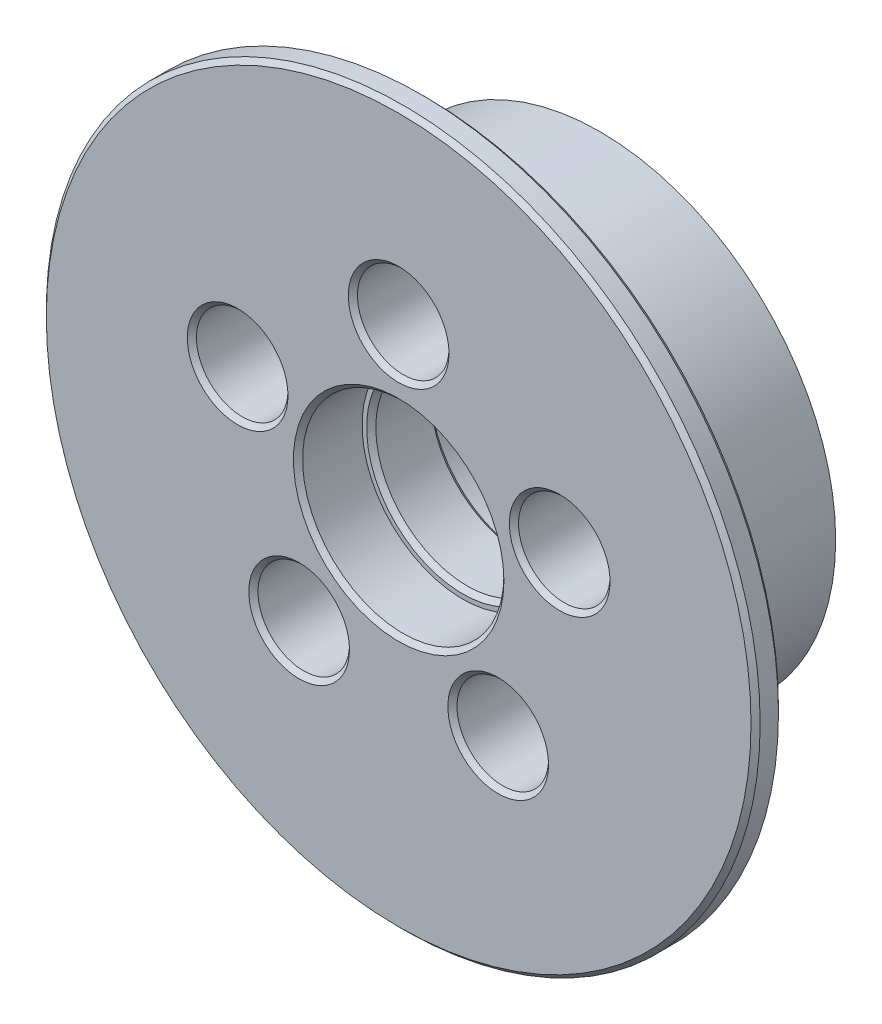
ISO-10303-21;
HEADER;
FILE_DESCRIPTION(('STEP AP214'),'2;1');
FILE_NAME('part.step','',(''),(''),'','','');
FILE_SCHEMA(('AUTOMOTIVE_DESIGN { 1 0 10303 214 1 1 1 1 }'));
ENDSEC;
DATA;
#1=APPLICATION_CONTEXT('core data for automotive mechanical design processes');
#2=APPLICATION_PROTOCOL_DEFINITION('international standard','automotive_design',2000,#1);
#3=PRODUCT_CONTEXT('',#1,'mechanical');
#4=PRODUCT('Part','Part','',(#3));
#5=PRODUCT_RELATED_PRODUCT_CATEGORY('part','',(#4));
#6=PRODUCT_DEFINITION_FORMATION('','',#4);
#7=PRODUCT_DEFINITION_CONTEXT('part definition',#1,'design');
#8=PRODUCT_DEFINITION('design','',#6,#7);
#9=PRODUCT_DEFINITION_SHAPE('','',#8);
#10=(LENGTH_UNIT() NAMED_UNIT(*) SI_UNIT(.MILLI.,.METRE.));
#11=(NAMED_UNIT(*) PLANE_ANGLE_UNIT() SI_UNIT($,.RADIAN.));
#12=(NAMED_UNIT(*) SI_UNIT($,.STERADIAN.) SOLID_ANGLE_UNIT());
#13=UNCERTAINTY_MEASURE_WITH_UNIT(LENGTH_MEASURE(1.E-05),#10,'distance_accuracy_value','');
#14=(GEOMETRIC_REPRESENTATION_CONTEXT(3) GLOBAL_UNCERTAINTY_ASSIGNED_CONTEXT((#13)) GLOBAL_UNIT_ASSIGNED_CONTEXT((#10,
#11,#12)) REPRESENTATION_CONTEXT('',''));
#15=CARTESIAN_POINT('',(0.,0.,0.));
#16=DIRECTION('',(0.,0.,1.));
#17=DIRECTION('',(1.,0.,0.));
#18=AXIS2_PLACEMENT_3D('',#15,#16,#17);
#19=CARTESIAN_POINT('',(0.,0.,22.));
#20=DIRECTION('',(0.,0.,-1.));
#21=DIRECTION('',(-1.,0.,0.));
#22=AXIS2_PLACEMENT_3D('',#19,#20,#21);
#23=CYLINDRICAL_SURFACE('',#22,10.);
#24=CARTESIAN_POINT('',(0.,0.,8.49999999999998));
#25=DIRECTION('',(0.,0.,-1.));
#26=DIRECTION('',(-1.,0.,0.));
#27=AXIS2_PLACEMENT_3D('',#24,#25,#26);
#28=CIRCLE('',#27,10.);
#29=CARTESIAN_POINT('',(-10.,0.,8.49999999999998));
#30=VERTEX_POINT('',#29);
#31=EDGE_CURVE('E91',#30,#30,#28,.T.);
#32=ORIENTED_EDGE('',*,*,#31,.T.);
#33=EDGE_LOOP('',(#32));
#34=FACE_BOUND('',#33,.T.);
#35=CARTESIAN_POINT('',(0.,0.,14.5));
#36=DIRECTION('',(0.,0.,1.));
#37=DIRECTION('',(1.,0.,0.));
#38=AXIS2_PLACEMENT_3D('',#35,#36,#37);
#39=CIRCLE('',#38,10.);
#40=CARTESIAN_POINT('',(10.,0.,14.5));
#41=VERTEX_POINT('',#40);
#42=EDGE_CURVE('E94',#41,#41,#39,.T.);
#43=ORIENTED_EDGE('',*,*,#42,.T.);
#44=EDGE_LOOP('',(#43));
#45=FACE_BOUND('',#44,.T.);
#46=ADVANCED_FACE('F32',(#34,#45),#23,.F.);
#47=CARTESIAN_POINT('',(0.,0.,19.));
#48=DIRECTION('',(0.,0.,-1.));
#49=DIRECTION('',(-1.,0.,0.));
#50=AXIS2_PLACEMENT_3D('',#47,#48,#49);
#51=CYLINDRICAL_SURFACE('',#50,25.75);
#52=CARTESIAN_POINT('',(0.,0.,19.));
#53=DIRECTION('',(0.,0.,1.));
#54=DIRECTION('',(1.,0.,0.));
#55=AXIS2_PLACEMENT_3D('',#52,#53,#54);
#56=CIRCLE('',#55,25.75);
#57=CARTESIAN_POINT('',(25.75,0.,19.));
#58=VERTEX_POINT('',#57);
#59=EDGE_CURVE('E136',#58,#58,#56,.T.);
#60=ORIENTED_EDGE('',*,*,#59,.F.);
#61=EDGE_LOOP('',(#60));
#62=FACE_BOUND('',#61,.T.);
#63=CARTESIAN_POINT('',(0.,0.,0.));
#64=DIRECTION('',(0.,0.,1.));
#65=DIRECTION('',(1.,0.,0.));
#66=AXIS2_PLACEMENT_3D('',#63,#64,#65);
#67=CIRCLE('',#66,25.75);
#68=CARTESIAN_POINT('',(25.75,0.,0.));
#69=VERTEX_POINT('',#68);
#70=EDGE_CURVE('E137',#69,#69,#67,.T.);
#71=ORIENTED_EDGE('',*,*,#70,.T.);
#72=EDGE_LOOP('',(#71));
#73=FACE_BOUND('',#72,.T.);
#74=ADVANCED_FACE('F168',(#62,#73),#51,.T.);
#75=CARTESIAN_POINT('',(0.,0.,0.));
#76=DIRECTION('',(0.,0.,1.));
#77=DIRECTION('',(1.,0.,0.));
#78=AXIS2_PLACEMENT_3D('',#75,#76,#77);
#79=PLANE('',#78);
#80=CARTESIAN_POINT('',(0.,18.5,0.));
#81=DIRECTION('',(0.,0.,1.));
#82=DIRECTION('',(1.,0.,0.));
#83=AXIS2_PLACEMENT_3D('',#80,#81,#82);
#84=CIRCLE('',#83,6.);
#85=CARTESIAN_POINT('',(6.,18.5,0.));
#86=VERTEX_POINT('',#85);
#87=EDGE_CURVE('E52',#86,#86,#84,.T.);
#88=ORIENTED_EDGE('',*,*,#87,.T.);
#89=EDGE_LOOP('',(#88));
#90=FACE_BOUND('',#89,.T.);
#91=CARTESIAN_POINT('',(-17.5945455514603,5.71681439593653,0.));
#92=DIRECTION('',(0.,0.,1.));
#93=DIRECTION('',(1.,0.,0.));
#94=AXIS2_PLACEMENT_3D('',#91,#92,#93);
#95=CIRCLE('',#94,6.);
#96=CARTESIAN_POINT('',(-11.5945455514603,5.71681439593653,0.));
#97=VERTEX_POINT('',#96);
#98=EDGE_CURVE('E55',#97,#97,#95,.T.);
#99=ORIENTED_EDGE('',*,*,#98,.T.);
#100=EDGE_LOOP('',(#99));
#101=FACE_BOUND('',#100,.T.);
#102=CARTESIAN_POINT('',(-10.8740271674108,-14.9668143959365,0.));
#103=DIRECTION('',(0.,0.,1.));
#104=DIRECTION('',(1.,0.,0.));
#105=AXIS2_PLACEMENT_3D('',#102,#103,#104);
#106=CIRCLE('',#105,6.);
#107=CARTESIAN_POINT('',(-4.87402716741075,-14.9668143959365,0.));
#108=VERTEX_POINT('',#107);
#109=EDGE_CURVE('E58',#108,#108,#106,.T.);
#110=ORIENTED_EDGE('',*,*,#109,.T.);
#111=EDGE_LOOP('',(#110));
#112=FACE_BOUND('',#111,.T.);
#113=CARTESIAN_POINT('',(10.8740271674108,-14.9668143959365,0.));
#114=DIRECTION('',(0.,0.,1.));
#115=DIRECTION('',(1.,0.,0.));
#116=AXIS2_PLACEMENT_3D('',#113,#114,#115);
#117=CIRCLE('',#116,6.);
#118=CARTESIAN_POINT('',(16.8740271674108,-14.9668143959365,0.));
#119=VERTEX_POINT('',#118);
#120=EDGE_CURVE('E61',#119,#119,#117,.T.);
#121=ORIENTED_EDGE('',*,*,#120,.T.);
#122=EDGE_LOOP('',(#121));
#123=FACE_BOUND('',#122,.T.);
#124=CARTESIAN_POINT('',(17.5945455514603,5.71681439593652,0.));
#125=DIRECTION('',(0.,0.,1.));
#126=DIRECTION('',(1.,0.,0.));
#127=AXIS2_PLACEMENT_3D('',#124,#125,#126);
#128=CIRCLE('',#127,6.);
#129=CARTESIAN_POINT('',(23.5945455514603,5.71681439593652,0.));
#130=VERTEX_POINT('',#129);
#131=EDGE_CURVE('E64',#130,#130,#128,.T.);
#132=ORIENTED_EDGE('',*,*,#131,.T.);
#133=EDGE_LOOP('',(#132));
#134=FACE_BOUND('',#133,.T.);
#135=CARTESIAN_POINT('',(0.,0.,0.));
#136=DIRECTION('',(0.,0.,1.));
#137=DIRECTION('',(1.,0.,0.));
#138=AXIS2_PLACEMENT_3D('',#135,#136,#137);
#139=CIRCLE('',#138,11.5);
#140=CARTESIAN_POINT('',(11.5,0.,0.));
#141=VERTEX_POINT('',#140);
#142=EDGE_CURVE('E100',#141,#141,#139,.T.);
#143=ORIENTED_EDGE('',*,*,#142,.T.);
#144=EDGE_LOOP('',(#143));
#145=FACE_BOUND('',#144,.T.);
#146=ORIENTED_EDGE('',*,*,#70,.F.);
#147=EDGE_LOOP('',(#146));
#148=FACE_BOUND('',#147,.T.);
#149=ADVANCED_FACE('F174',(#90,#101,#112,#123,#134,#145,#148),#79,.F.);
#150=CARTESIAN_POINT('',(0.,0.,22.));
#151=DIRECTION('',(0.,0.,-1.));
#152=DIRECTION('',(-1.,0.,0.));
#153=AXIS2_PLACEMENT_3D('',#150,#151,#152);
#154=CYLINDRICAL_SURFACE('',#153,39.);
#155=CARTESIAN_POINT('',(0.,0.,21.5));
#156=DIRECTION('',(0.,0.,1.));
#157=DIRECTION('',(1.,0.,0.));
#158=AXIS2_PLACEMENT_3D('',#155,#156,#157);
#159=CIRCLE('',#158,39.);
#160=CARTESIAN_POINT('',(39.,0.,21.5));
#161=VERTEX_POINT('',#160);
#162=EDGE_CURVE('E109',#161,#161,#159,.F.);
#163=ORIENTED_EDGE('',*,*,#162,.T.);
#164=EDGE_LOOP('',(#163));
#165=FACE_BOUND('',#164,.T.);
#166=CARTESIAN_POINT('',(0.,0.,19.5));
#167=DIRECTION('',(0.,0.,1.));
#168=DIRECTION('',(1.,0.,0.));
#169=AXIS2_PLACEMENT_3D('',#166,#167,#168);
#170=CIRCLE('',#169,39.);
#171=CARTESIAN_POINT('',(39.,0.,19.5));
#172=VERTEX_POINT('',#171);
#173=EDGE_CURVE('E112',#172,#172,#170,.T.);
#174=ORIENTED_EDGE('',*,*,#173,.T.);
#175=EDGE_LOOP('',(#174));
#176=FACE_BOUND('',#175,.T.);
#177=ADVANCED_FACE('F203',(#165,#176),#154,.T.);
#178=CARTESIAN_POINT('',(0.,0.,22.));
#179=DIRECTION('',(0.,0.,1.));
#180=DIRECTION('',(1.,0.,0.));
#181=AXIS2_PLACEMENT_3D('',#178,#179,#180);
#182=PLANE('',#181);
#183=CARTESIAN_POINT('',(0.,0.,22.));
#184=DIRECTION('',(0.,0.,1.));
#185=DIRECTION('',(1.,0.,0.));
#186=AXIS2_PLACEMENT_3D('',#183,#184,#185);
#187=CIRCLE('',#186,38.5);
#188=CARTESIAN_POINT('',(38.5,0.,22.));
#189=VERTEX_POINT('',#188);
#190=EDGE_CURVE('E115',#189,#189,#187,.T.);
#191=ORIENTED_EDGE('',*,*,#190,.T.);
#192=EDGE_LOOP('',(#191));
#193=FACE_BOUND('',#192,.T.);
#194=CARTESIAN_POINT('',(0.,0.,22.));
#195=DIRECTION('',(0.,0.,1.));
#196=DIRECTION('',(1.,0.,0.));
#197=AXIS2_PLACEMENT_3D('',#194,#195,#196);
#198=CIRCLE('',#197,11.5);
#199=CARTESIAN_POINT('',(11.5,0.,22.));
#200=VERTEX_POINT('',#199);
#201=EDGE_CURVE('E118',#200,#200,#198,.F.);
#202=ORIENTED_EDGE('',*,*,#201,.T.);
#203=EDGE_LOOP('',(#202));
#204=FACE_BOUND('',#203,.T.);
#205=CARTESIAN_POINT('',(-10.8740271674108,-14.9668143959365,22.));
#206=DIRECTION('',(0.,0.,1.));
#207=DIRECTION('',(1.,0.,0.));
#208=AXIS2_PLACEMENT_3D('',#205,#206,#207);
#209=CIRCLE('',#208,5.50000000000001);
#210=CARTESIAN_POINT('',(-5.37402716741075,-14.9668143959365,22.));
#211=VERTEX_POINT('',#210);
#212=EDGE_CURVE('E121',#211,#211,#209,.F.);
#213=ORIENTED_EDGE('',*,*,#212,.T.);
#214=EDGE_LOOP('',(#213));
#215=FACE_BOUND('',#214,.T.);
#216=CARTESIAN_POINT('',(10.8740271674108,-14.9668143959365,22.));
#217=DIRECTION('',(0.,0.,1.));
#218=DIRECTION('',(1.,0.,0.));
#219=AXIS2_PLACEMENT_3D('',#216,#217,#218);
#220=CIRCLE('',#219,5.50000000000001);
#221=CARTESIAN_POINT('',(16.3740271674108,-14.9668143959365,22.));
#222=VERTEX_POINT('',#221);
#223=EDGE_CURVE('E124',#222,#222,#220,.F.);
#224=ORIENTED_EDGE('',*,*,#223,.T.);
#225=EDGE_LOOP('',(#224));
#226=FACE_BOUND('',#225,.T.);
#227=CARTESIAN_POINT('',(17.5945455514603,5.71681439593652,22.));
#228=DIRECTION('',(0.,0.,1.));
#229=DIRECTION('',(1.,0.,0.));
#230=AXIS2_PLACEMENT_3D('',#227,#228,#229);
#231=CIRCLE('',#230,5.50000000000001);
#232=CARTESIAN_POINT('',(23.0945455514603,5.71681439593652,22.));
#233=VERTEX_POINT('',#232);
#234=EDGE_CURVE('E127',#233,#233,#231,.F.);
#235=ORIENTED_EDGE('',*,*,#234,.T.);
#236=EDGE_LOOP('',(#235));
#237=FACE_BOUND('',#236,.T.);
#238=CARTESIAN_POINT('',(0.,18.5,22.));
#239=DIRECTION('',(0.,0.,1.));
#240=DIRECTION('',(1.,0.,0.));
#241=AXIS2_PLACEMENT_3D('',#238,#239,#240);
#242=CIRCLE('',#241,5.50000000000001);
#243=CARTESIAN_POINT('',(5.50000000000001,18.5,22.));
#244=VERTEX_POINT('',#243);
#245=EDGE_CURVE('E130',#244,#244,#242,.F.);
#246=ORIENTED_EDGE('',*,*,#245,.T.);
#247=EDGE_LOOP('',(#246));
#248=FACE_BOUND('',#247,.T.);
#249=CARTESIAN_POINT('',(-17.5945455514603,5.71681439593653,22.));
#250=DIRECTION('',(0.,0.,1.));
#251=DIRECTION('',(1.,0.,0.));
#252=AXIS2_PLACEMENT_3D('',#249,#250,#251);
#253=CIRCLE('',#252,5.50000000000001);
#254=CARTESIAN_POINT('',(-12.0945455514603,5.71681439593653,22.));
#255=VERTEX_POINT('',#254);
#256=EDGE_CURVE('E133',#255,#255,#253,.F.);
#257=ORIENTED_EDGE('',*,*,#256,.T.);
#258=EDGE_LOOP('',(#257));
#259=FACE_BOUND('',#258,.T.);
#260=ADVANCED_FACE('F200',(#193,#204,#215,#226,#237,#248,#259),#182,.T.);
#261=CARTESIAN_POINT('',(0.,0.,19.));
#262=DIRECTION('',(0.,0.,1.));
#263=DIRECTION('',(1.,0.,0.));
#264=AXIS2_PLACEMENT_3D('',#261,#262,#263);
#265=PLANE('',#264);
#266=CARTESIAN_POINT('',(0.,0.,19.));
#267=DIRECTION('',(0.,0.,1.));
#268=DIRECTION('',(1.,0.,0.));
#269=AXIS2_PLACEMENT_3D('',#266,#267,#268);
#270=CIRCLE('',#269,38.5);
#271=CARTESIAN_POINT('',(38.5,0.,19.));
#272=VERTEX_POINT('',#271);
#273=EDGE_CURVE('E106',#272,#272,#270,.F.);
#274=ORIENTED_EDGE('',*,*,#273,.T.);
#275=EDGE_LOOP('',(#274));
#276=FACE_BOUND('',#275,.T.);
#277=ORIENTED_EDGE('',*,*,#59,.T.);
#278=EDGE_LOOP('',(#277));
#279=FACE_BOUND('',#278,.T.);
#280=ADVANCED_FACE('F199',(#276,#279),#265,.F.);
#281=CARTESIAN_POINT('',(17.5945455514603,5.71681439593652,22.));
#282=DIRECTION('',(0.,0.,-1.));
#283=DIRECTION('',(-1.,0.,0.));
#284=AXIS2_PLACEMENT_3D('',#281,#282,#283);
#285=CYLINDRICAL_SURFACE('',#284,5.);
#286=CARTESIAN_POINT('',(17.5945455514603,5.71681439593652,1.));
#287=DIRECTION('',(0.,0.,1.));
#288=DIRECTION('',(1.,0.,0.));
#289=AXIS2_PLACEMENT_3D('',#286,#287,#288);
#290=CIRCLE('',#289,5.);
#291=CARTESIAN_POINT('',(22.5945455514603,5.71681439593652,1.));
#292=VERTEX_POINT('',#291);
#293=EDGE_CURVE('E10',#292,#292,#290,.F.);
#294=ORIENTED_EDGE('',*,*,#293,.T.);
#295=EDGE_LOOP('',(#294));
#296=FACE_BOUND('',#295,.T.);
#297=CARTESIAN_POINT('',(17.5945455514603,5.71681439593652,21.5));
#298=DIRECTION('',(0.,0.,1.));
#299=DIRECTION('',(1.,0.,0.));
#300=AXIS2_PLACEMENT_3D('',#297,#298,#299);
#301=CIRCLE('',#300,5.);
#302=CARTESIAN_POINT('',(22.5945455514603,5.71681439593652,21.5));
#303=VERTEX_POINT('',#302);
#304=EDGE_CURVE('E76',#303,#303,#301,.T.);
#305=ORIENTED_EDGE('',*,*,#304,.T.);
#306=EDGE_LOOP('',(#305));
#307=FACE_BOUND('',#306,.T.);
#308=ADVANCED_FACE('F196',(#296,#307),#285,.F.);
#309=CARTESIAN_POINT('',(10.8740271674108,-14.9668143959365,22.));
#310=DIRECTION('',(0.,0.,-1.));
#311=DIRECTION('',(-1.,0.,0.));
#312=AXIS2_PLACEMENT_3D('',#309,#310,#311);
#313=CYLINDRICAL_SURFACE('',#312,5.);
#314=CARTESIAN_POINT('',(10.8740271674108,-14.9668143959365,1.));
#315=DIRECTION('',(0.,0.,1.));
#316=DIRECTION('',(1.,0.,0.));
#317=AXIS2_PLACEMENT_3D('',#314,#315,#316);
#318=CIRCLE('',#317,5.);
#319=CARTESIAN_POINT('',(15.8740271674108,-14.9668143959365,1.));
#320=VERTEX_POINT('',#319);
#321=EDGE_CURVE('E39',#320,#320,#318,.F.);
#322=ORIENTED_EDGE('',*,*,#321,.T.);
#323=EDGE_LOOP('',(#322));
#324=FACE_BOUND('',#323,.T.);
#325=CARTESIAN_POINT('',(10.8740271674108,-14.9668143959365,21.5));
#326=DIRECTION('',(0.,0.,1.));
#327=DIRECTION('',(1.,0.,0.));
#328=AXIS2_PLACEMENT_3D('',#325,#326,#327);
#329=CIRCLE('',#328,5.);
#330=CARTESIAN_POINT('',(15.8740271674108,-14.9668143959365,21.5));
#331=VERTEX_POINT('',#330);
#332=EDGE_CURVE('E79',#331,#331,#329,.T.);
#333=ORIENTED_EDGE('',*,*,#332,.T.);
#334=EDGE_LOOP('',(#333));
#335=FACE_BOUND('',#334,.T.);
#336=ADVANCED_FACE('F192',(#324,#335),#313,.F.);
#337=CARTESIAN_POINT('',(-10.8740271674108,-14.9668143959365,22.));
#338=DIRECTION('',(0.,0.,-1.));
#339=DIRECTION('',(-1.,0.,0.));
#340=AXIS2_PLACEMENT_3D('',#337,#338,#339);
#341=CYLINDRICAL_SURFACE('',#340,5.);
#342=CARTESIAN_POINT('',(-10.8740271674108,-14.9668143959365,1.));
#343=DIRECTION('',(0.,0.,1.));
#344=DIRECTION('',(1.,0.,0.));
#345=AXIS2_PLACEMENT_3D('',#342,#343,#344);
#346=CIRCLE('',#345,5.);
#347=CARTESIAN_POINT('',(-5.87402716741075,-14.9668143959365,1.));
#348=VERTEX_POINT('',#347);
#349=EDGE_CURVE('E43',#348,#348,#346,.F.);
#350=ORIENTED_EDGE('',*,*,#349,.T.);
#351=EDGE_LOOP('',(#350));
#352=FACE_BOUND('',#351,.T.);
#353=CARTESIAN_POINT('',(-10.8740271674108,-14.9668143959365,21.5));
#354=DIRECTION('',(0.,0.,1.));
#355=DIRECTION('',(1.,0.,0.));
#356=AXIS2_PLACEMENT_3D('',#353,#354,#355);
#357=CIRCLE('',#356,5.);
#358=CARTESIAN_POINT('',(-5.87402716741075,-14.9668143959365,21.5));
#359=VERTEX_POINT('',#358);
#360=EDGE_CURVE('E82',#359,#359,#357,.T.);
#361=ORIENTED_EDGE('',*,*,#360,.T.);
#362=EDGE_LOOP('',(#361));
#363=FACE_BOUND('',#362,.T.);
#364=ADVANCED_FACE('F188',(#352,#363),#341,.F.);
#365=CARTESIAN_POINT('',(-17.5945455514603,5.71681439593653,22.));
#366=DIRECTION('',(0.,0.,-1.));
#367=DIRECTION('',(-1.,0.,0.));
#368=AXIS2_PLACEMENT_3D('',#365,#366,#367);
#369=CYLINDRICAL_SURFACE('',#368,5.);
#370=CARTESIAN_POINT('',(-17.5945455514603,5.71681439593653,1.));
#371=DIRECTION('',(0.,0.,1.));
#372=DIRECTION('',(1.,0.,0.));
#373=AXIS2_PLACEMENT_3D('',#370,#371,#372);
#374=CIRCLE('',#373,5.);
#375=CARTESIAN_POINT('',(-12.5945455514603,5.71681439593653,1.));
#376=VERTEX_POINT('',#375);
#377=EDGE_CURVE('E47',#376,#376,#374,.F.);
#378=ORIENTED_EDGE('',*,*,#377,.T.);
#379=EDGE_LOOP('',(#378));
#380=FACE_BOUND('',#379,.T.);
#381=CARTESIAN_POINT('',(-17.5945455514603,5.71681439593653,21.5));
#382=DIRECTION('',(0.,0.,1.));
#383=DIRECTION('',(1.,0.,0.));
#384=AXIS2_PLACEMENT_3D('',#381,#382,#383);
#385=CIRCLE('',#384,5.);
#386=CARTESIAN_POINT('',(-12.5945455514603,5.71681439593653,21.5));
#387=VERTEX_POINT('',#386);
#388=EDGE_CURVE('E70',#387,#387,#385,.T.);
#389=ORIENTED_EDGE('',*,*,#388,.T.);
#390=EDGE_LOOP('',(#389));
#391=FACE_BOUND('',#390,.T.);
#392=ADVANCED_FACE('F184',(#380,#391),#369,.F.);
#393=CARTESIAN_POINT('',(0.,18.5,22.));
#394=DIRECTION('',(0.,0.,-1.));
#395=DIRECTION('',(-1.,0.,0.));
#396=AXIS2_PLACEMENT_3D('',#393,#394,#395);
#397=CYLINDRICAL_SURFACE('',#396,5.);
#398=CARTESIAN_POINT('',(0.,18.5,1.));
#399=DIRECTION('',(0.,0.,1.));
#400=DIRECTION('',(1.,0.,0.));
#401=AXIS2_PLACEMENT_3D('',#398,#399,#400);
#402=CIRCLE('',#401,5.);
#403=CARTESIAN_POINT('',(5.,18.5,1.));
#404=VERTEX_POINT('',#403);
#405=EDGE_CURVE('E67',#404,#404,#402,.F.);
#406=ORIENTED_EDGE('',*,*,#405,.T.);
#407=EDGE_LOOP('',(#406));
#408=FACE_BOUND('',#407,.T.);
#409=CARTESIAN_POINT('',(0.,18.5,21.5));
#410=DIRECTION('',(0.,0.,1.));
#411=DIRECTION('',(1.,0.,0.));
#412=AXIS2_PLACEMENT_3D('',#409,#410,#411);
#413=CIRCLE('',#412,5.);
#414=CARTESIAN_POINT('',(5.,18.5,21.5));
#415=VERTEX_POINT('',#414);
#416=EDGE_CURVE('E73',#415,#415,#413,.T.);
#417=ORIENTED_EDGE('',*,*,#416,.T.);
#418=EDGE_LOOP('',(#417));
#419=FACE_BOUND('',#418,.T.);
#420=ADVANCED_FACE('F180',(#408,#419),#397,.F.);
#421=CARTESIAN_POINT('',(0.,0.,8.));
#422=DIRECTION('',(0.,0.,-1.));
#423=DIRECTION('',(-1.,0.,0.));
#424=AXIS2_PLACEMENT_3D('',#421,#422,#423);
#425=PLANE('',#424);
#426=CARTESIAN_POINT('',(0.,0.,8.));
#427=DIRECTION('',(0.,0.,-1.));
#428=DIRECTION('',(-1.,0.,0.));
#429=AXIS2_PLACEMENT_3D('',#426,#427,#428);
#430=CIRCLE('',#429,10.5);
#431=CARTESIAN_POINT('',(-10.5,0.,8.));
#432=VERTEX_POINT('',#431);
#433=EDGE_CURVE('E97',#432,#432,#430,.F.);
#434=ORIENTED_EDGE('',*,*,#433,.T.);
#435=EDGE_LOOP('',(#434));
#436=FACE_BOUND('',#435,.T.);
#437=CARTESIAN_POINT('',(0.,0.,8.));
#438=DIRECTION('',(0.,0.,-1.));
#439=DIRECTION('',(-1.,0.,0.));
#440=AXIS2_PLACEMENT_3D('',#437,#438,#439);
#441=CIRCLE('',#440,11.);
#442=CARTESIAN_POINT('',(-11.,0.,8.));
#443=VERTEX_POINT('',#442);
#444=EDGE_CURVE('E140',#443,#443,#441,.T.);
#445=ORIENTED_EDGE('',*,*,#444,.T.);
#446=EDGE_LOOP('',(#445));
#447=FACE_BOUND('',#446,.T.);
#448=ADVANCED_FACE('F183',(#436,#447),#425,.T.);
#449=CARTESIAN_POINT('',(0.,0.,8.));
#450=DIRECTION('',(0.,0.,-1.));
#451=DIRECTION('',(-1.,0.,0.));
#452=AXIS2_PLACEMENT_3D('',#449,#450,#451);
#453=CYLINDRICAL_SURFACE('',#452,11.);
#454=CARTESIAN_POINT('',(0.,0.,0.500000000000021));
#455=DIRECTION('',(0.,0.,1.));
#456=DIRECTION('',(1.,0.,0.));
#457=AXIS2_PLACEMENT_3D('',#454,#455,#456);
#458=CIRCLE('',#457,11.);
#459=CARTESIAN_POINT('',(11.,0.,0.500000000000021));
#460=VERTEX_POINT('',#459);
#461=EDGE_CURVE('E103',#460,#460,#458,.F.);
#462=ORIENTED_EDGE('',*,*,#461,.T.);
#463=EDGE_LOOP('',(#462));
#464=FACE_BOUND('',#463,.T.);
#465=ORIENTED_EDGE('',*,*,#444,.F.);
#466=EDGE_LOOP('',(#465));
#467=FACE_BOUND('',#466,.T.);
#468=ADVANCED_FACE('F163',(#464,#467),#453,.F.);
#469=CARTESIAN_POINT('',(0.,0.,15.));
#470=DIRECTION('',(0.,0.,1.));
#471=DIRECTION('',(1.,0.,0.));
#472=AXIS2_PLACEMENT_3D('',#469,#470,#471);
#473=PLANE('',#472);
#474=CARTESIAN_POINT('',(0.,0.,15.));
#475=DIRECTION('',(0.,0.,1.));
#476=DIRECTION('',(1.,0.,0.));
#477=AXIS2_PLACEMENT_3D('',#474,#475,#476);
#478=CIRCLE('',#477,10.5);
#479=CARTESIAN_POINT('',(10.5,0.,15.));
#480=VERTEX_POINT('',#479);
#481=EDGE_CURVE('E88',#480,#480,#478,.F.);
#482=ORIENTED_EDGE('',*,*,#481,.T.);
#483=EDGE_LOOP('',(#482));
#484=FACE_BOUND('',#483,.T.);
#485=CARTESIAN_POINT('',(0.,0.,15.));
#486=DIRECTION('',(0.,0.,1.));
#487=DIRECTION('',(1.,0.,0.));
#488=AXIS2_PLACEMENT_3D('',#485,#486,#487);
#489=CIRCLE('',#488,11.);
#490=CARTESIAN_POINT('',(11.,0.,15.));
#491=VERTEX_POINT('',#490);
#492=EDGE_CURVE('E145',#491,#491,#489,.T.);
#493=ORIENTED_EDGE('',*,*,#492,.T.);
#494=EDGE_LOOP('',(#493));
#495=FACE_BOUND('',#494,.T.);
#496=ADVANCED_FACE('F149',(#484,#495),#473,.T.);
#497=CARTESIAN_POINT('',(0.,0.,15.));
#498=DIRECTION('',(0.,0.,1.));
#499=DIRECTION('',(1.,0.,0.));
#500=AXIS2_PLACEMENT_3D('',#497,#498,#499);
#501=CYLINDRICAL_SURFACE('',#500,11.);
#502=CARTESIAN_POINT('',(0.,0.,21.5));
#503=DIRECTION('',(0.,0.,1.));
#504=DIRECTION('',(1.,0.,0.));
#505=AXIS2_PLACEMENT_3D('',#502,#503,#504);
#506=CIRCLE('',#505,11.);
#507=CARTESIAN_POINT('',(11.,0.,21.5));
#508=VERTEX_POINT('',#507);
#509=EDGE_CURVE('E85',#508,#508,#506,.T.);
#510=ORIENTED_EDGE('',*,*,#509,.T.);
#511=EDGE_LOOP('',(#510));
#512=FACE_BOUND('',#511,.T.);
#513=ORIENTED_EDGE('',*,*,#492,.F.);
#514=EDGE_LOOP('',(#513));
#515=FACE_BOUND('',#514,.T.);
#516=ADVANCED_FACE('F151',(#512,#515),#501,.F.);
#517=CARTESIAN_POINT('',(0.,0.,22.));
#518=DIRECTION('',(0.,0.,-1.));
#519=DIRECTION('',(-1.,0.,0.));
#520=AXIS2_PLACEMENT_3D('',#517,#518,#519);
#521=CONICAL_SURFACE('',#520,38.5,0.785398163397441);
#522=ORIENTED_EDGE('',*,*,#162,.F.);
#523=EDGE_LOOP('',(#522));
#524=FACE_BOUND('',#523,.T.);
#525=ORIENTED_EDGE('',*,*,#190,.F.);
#526=EDGE_LOOP('',(#525));
#527=FACE_BOUND('',#526,.T.);
#528=ADVANCED_FACE('F153',(#524,#527),#521,.T.);
#529=CARTESIAN_POINT('',(0.,0.,19.5));
#530=DIRECTION('',(0.,0.,1.));
#531=DIRECTION('',(1.,0.,0.));
#532=AXIS2_PLACEMENT_3D('',#529,#530,#531);
#533=CONICAL_SURFACE('',#532,39.,0.785398163397455);
#534=ORIENTED_EDGE('',*,*,#273,.F.);
#535=EDGE_LOOP('',(#534));
#536=FACE_BOUND('',#535,.T.);
#537=ORIENTED_EDGE('',*,*,#173,.F.);
#538=EDGE_LOOP('',(#537));
#539=FACE_BOUND('',#538,.T.);
#540=ADVANCED_FACE('F160',(#536,#539),#533,.T.);
#541=CARTESIAN_POINT('',(0.,0.,0.500000000000021));
#542=DIRECTION('',(0.,0.,-1.));
#543=DIRECTION('',(-1.,0.,0.));
#544=AXIS2_PLACEMENT_3D('',#541,#542,#543);
#545=CONICAL_SURFACE('',#544,11.,0.785398163397452);
#546=ORIENTED_EDGE('',*,*,#142,.F.);
#547=EDGE_LOOP('',(#546));
#548=FACE_BOUND('',#547,.T.);
#549=ORIENTED_EDGE('',*,*,#461,.F.);
#550=EDGE_LOOP('',(#549));
#551=FACE_BOUND('',#550,.T.);
#552=ADVANCED_FACE('F216',(#548,#551),#545,.F.);
#553=CARTESIAN_POINT('',(0.,0.,8.));
#554=DIRECTION('',(0.,0.,-1.));
#555=DIRECTION('',(-1.,0.,0.));
#556=AXIS2_PLACEMENT_3D('',#553,#554,#555);
#557=CONICAL_SURFACE('',#556,10.5,0.785398163397441);
#558=ORIENTED_EDGE('',*,*,#31,.F.);
#559=EDGE_LOOP('',(#558));
#560=FACE_BOUND('',#559,.T.);
#561=ORIENTED_EDGE('',*,*,#433,.F.);
#562=EDGE_LOOP('',(#561));
#563=FACE_BOUND('',#562,.T.);
#564=ADVANCED_FACE('F220',(#560,#563),#557,.F.);
#565=CARTESIAN_POINT('',(0.,0.,15.));
#566=DIRECTION('',(0.,0.,1.));
#567=DIRECTION('',(1.,0.,0.));
#568=AXIS2_PLACEMENT_3D('',#565,#566,#567);
#569=CONICAL_SURFACE('',#568,10.5,0.785398163397455);
#570=ORIENTED_EDGE('',*,*,#42,.F.);
#571=EDGE_LOOP('',(#570));
#572=FACE_BOUND('',#571,.T.);
#573=ORIENTED_EDGE('',*,*,#481,.F.);
#574=EDGE_LOOP('',(#573));
#575=FACE_BOUND('',#574,.T.);
#576=ADVANCED_FACE('F224',(#572,#575),#569,.F.);
#577=CARTESIAN_POINT('',(0.,0.,21.5));
#578=DIRECTION('',(0.,0.,1.));
#579=DIRECTION('',(1.,0.,0.));
#580=AXIS2_PLACEMENT_3D('',#577,#578,#579);
#581=CONICAL_SURFACE('',#580,11.,0.785398163397459);
#582=ORIENTED_EDGE('',*,*,#201,.F.);
#583=EDGE_LOOP('',(#582));
#584=FACE_BOUND('',#583,.T.);
#585=ORIENTED_EDGE('',*,*,#509,.F.);
#586=EDGE_LOOP('',(#585));
#587=FACE_BOUND('',#586,.T.);
#588=ADVANCED_FACE('F228',(#584,#587),#581,.F.);
#589=CARTESIAN_POINT('',(-10.8740271674108,-14.9668143959365,22.));
#590=DIRECTION('',(0.,0.,1.));
#591=DIRECTION('',(1.,0.,0.));
#592=AXIS2_PLACEMENT_3D('',#589,#590,#591);
#593=CONICAL_SURFACE('',#592,5.50000000000001,0.78539816339745);
#594=ORIENTED_EDGE('',*,*,#360,.F.);
#595=EDGE_LOOP('',(#594));
#596=FACE_BOUND('',#595,.T.);
#597=ORIENTED_EDGE('',*,*,#212,.F.);
#598=EDGE_LOOP('',(#597));
#599=FACE_BOUND('',#598,.T.);
#600=ADVANCED_FACE('F232',(#596,#599),#593,.F.);
#601=CARTESIAN_POINT('',(10.8740271674108,-14.9668143959365,22.));
#602=DIRECTION('',(0.,0.,1.));
#603=DIRECTION('',(1.,0.,0.));
#604=AXIS2_PLACEMENT_3D('',#601,#602,#603);
#605=CONICAL_SURFACE('',#604,5.50000000000001,0.785398163397428);
#606=ORIENTED_EDGE('',*,*,#332,.F.);
#607=EDGE_LOOP('',(#606));
#608=FACE_BOUND('',#607,.T.);
#609=ORIENTED_EDGE('',*,*,#223,.F.);
#610=EDGE_LOOP('',(#609));
#611=FACE_BOUND('',#610,.T.);
#612=ADVANCED_FACE('F236',(#608,#611),#605,.F.);
#613=CARTESIAN_POINT('',(17.5945455514603,5.71681439593652,22.));
#614=DIRECTION('',(0.,0.,1.));
#615=DIRECTION('',(1.,0.,0.));
#616=AXIS2_PLACEMENT_3D('',#613,#614,#615);
#617=CONICAL_SURFACE('',#616,5.50000000000001,0.785398163397431);
#618=ORIENTED_EDGE('',*,*,#304,.F.);
#619=EDGE_LOOP('',(#618));
#620=FACE_BOUND('',#619,.T.);
#621=ORIENTED_EDGE('',*,*,#234,.F.);
#622=EDGE_LOOP('',(#621));
#623=FACE_BOUND('',#622,.T.);
#624=ADVANCED_FACE('F240',(#620,#623),#617,.F.);
#625=CARTESIAN_POINT('',(0.,18.5,22.));
#626=DIRECTION('',(0.,0.,1.));
#627=DIRECTION('',(1.,0.,0.));
#628=AXIS2_PLACEMENT_3D('',#625,#626,#627);
#629=CONICAL_SURFACE('',#628,5.50000000000001,0.785398163397453);
#630=ORIENTED_EDGE('',*,*,#416,.F.);
#631=EDGE_LOOP('',(#630));
#632=FACE_BOUND('',#631,.T.);
#633=ORIENTED_EDGE('',*,*,#245,.F.);
#634=EDGE_LOOP('',(#633));
#635=FACE_BOUND('',#634,.T.);
#636=ADVANCED_FACE('F244',(#632,#635),#629,.F.);
#637=CARTESIAN_POINT('',(-17.5945455514603,5.71681439593653,22.));
#638=DIRECTION('',(0.,0.,1.));
#639=DIRECTION('',(1.,0.,0.));
#640=AXIS2_PLACEMENT_3D('',#637,#638,#639);
#641=CONICAL_SURFACE('',#640,5.50000000000001,0.785398163397452);
#642=ORIENTED_EDGE('',*,*,#388,.F.);
#643=EDGE_LOOP('',(#642));
#644=FACE_BOUND('',#643,.T.);
#645=ORIENTED_EDGE('',*,*,#256,.F.);
#646=EDGE_LOOP('',(#645));
#647=FACE_BOUND('',#646,.T.);
#648=ADVANCED_FACE('F248',(#644,#647),#641,.F.);
#649=CARTESIAN_POINT('',(0.,18.5,1.));
#650=DIRECTION('',(0.,0.,1.));
#651=DIRECTION('',(1.,0.,0.));
#652=AXIS2_PLACEMENT_3D('',#649,#650,#651);
#653=TOROIDAL_SURFACE('',#652,6.,1.);
#654=ORIENTED_EDGE('',*,*,#87,.F.);
#655=EDGE_LOOP('',(#654));
#656=FACE_BOUND('',#655,.T.);
#657=ORIENTED_EDGE('',*,*,#405,.F.);
#658=EDGE_LOOP('',(#657));
#659=FACE_BOUND('',#658,.T.);
#660=ADVANCED_FACE('F252',(#656,#659),#653,.T.);
#661=CARTESIAN_POINT('',(-17.5945455514603,5.71681439593653,1.));
#662=DIRECTION('',(0.,0.,1.));
#663=DIRECTION('',(1.,0.,0.));
#664=AXIS2_PLACEMENT_3D('',#661,#662,#663);
#665=TOROIDAL_SURFACE('',#664,6.,1.);
#666=ORIENTED_EDGE('',*,*,#98,.F.);
#667=EDGE_LOOP('',(#666));
#668=FACE_BOUND('',#667,.T.);
#669=ORIENTED_EDGE('',*,*,#377,.F.);
#670=EDGE_LOOP('',(#669));
#671=FACE_BOUND('',#670,.T.);
#672=ADVANCED_FACE('F256',(#668,#671),#665,.T.);
#673=CARTESIAN_POINT('',(-10.8740271674108,-14.9668143959365,1.));
#674=DIRECTION('',(0.,0.,1.));
#675=DIRECTION('',(1.,0.,0.));
#676=AXIS2_PLACEMENT_3D('',#673,#674,#675);
#677=TOROIDAL_SURFACE('',#676,6.,1.);
#678=ORIENTED_EDGE('',*,*,#109,.F.);
#679=EDGE_LOOP('',(#678));
#680=FACE_BOUND('',#679,.T.);
#681=ORIENTED_EDGE('',*,*,#349,.F.);
#682=EDGE_LOOP('',(#681));
#683=FACE_BOUND('',#682,.T.);
#684=ADVANCED_FACE('F260',(#680,#683),#677,.T.);
#685=CARTESIAN_POINT('',(10.8740271674108,-14.9668143959365,1.));
#686=DIRECTION('',(0.,0.,1.));
#687=DIRECTION('',(1.,0.,0.));
#688=AXIS2_PLACEMENT_3D('',#685,#686,#687);
#689=TOROIDAL_SURFACE('',#688,6.,1.);
#690=ORIENTED_EDGE('',*,*,#120,.F.);
#691=EDGE_LOOP('',(#690));
#692=FACE_BOUND('',#691,.T.);
#693=ORIENTED_EDGE('',*,*,#321,.F.);
#694=EDGE_LOOP('',(#693));
#695=FACE_BOUND('',#694,.T.);
#696=ADVANCED_FACE('F263',(#692,#695),#689,.T.);
#697=CARTESIAN_POINT('',(17.5945455514603,5.71681439593652,1.));
#698=DIRECTION('',(0.,0.,1.));
#699=DIRECTION('',(1.,0.,0.));
#700=AXIS2_PLACEMENT_3D('',#697,#698,#699);
#701=TOROIDAL_SURFACE('',#700,6.,1.);
#702=ORIENTED_EDGE('',*,*,#131,.F.);
#703=EDGE_LOOP('',(#702));
#704=FACE_BOUND('',#703,.T.);
#705=ORIENTED_EDGE('',*,*,#293,.F.);
#706=EDGE_LOOP('',(#705));
#707=FACE_BOUND('',#706,.T.);
#708=ADVANCED_FACE('F34',(#704,#707),#701,.T.);
#709=CLOSED_SHELL('',(#46,#74,#149,#177,#260,#280,#308,#336,#364,#392,#420,#448,#468,#496,#516,
#528,#540,#552,#564,#576,#588,#600,#612,#624,#636,#648,#660,#672,#684,#696,#708));
#710=MANIFOLD_SOLID_BREP('B2',#709);
#711=ADVANCED_BREP_SHAPE_REPRESENTATION('',(#18,#710),#14);
#712=SHAPE_DEFINITION_REPRESENTATION(#9,#711);
ENDSEC;
END-ISO-10303-21;
